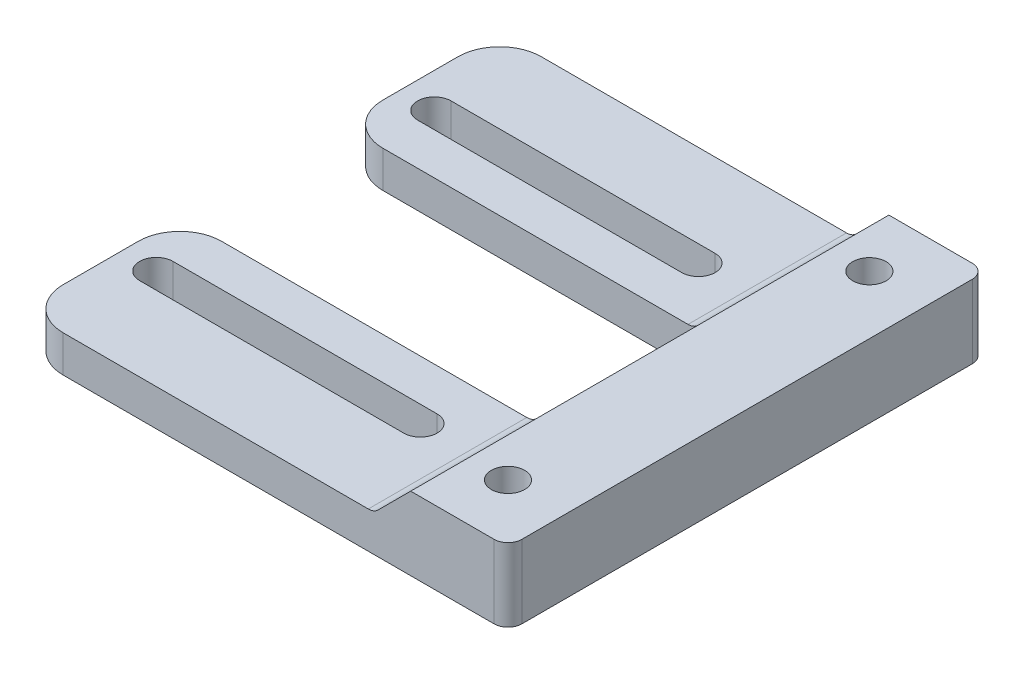
ISO-10303-21;
HEADER;
FILE_DESCRIPTION(('STEP AP214'),'2;1');
FILE_NAME('part.step','',(''),(''),'','','');
FILE_SCHEMA(('AUTOMOTIVE_DESIGN { 1 0 10303 214 1 1 1 1 }'));
ENDSEC;
DATA;
#1=APPLICATION_CONTEXT('core data for automotive mechanical design processes');
#2=APPLICATION_PROTOCOL_DEFINITION('international standard','automotive_design',2000,#1);
#3=PRODUCT_CONTEXT('',#1,'mechanical');
#4=PRODUCT('Part','Part','',(#3));
#5=PRODUCT_RELATED_PRODUCT_CATEGORY('part','',(#4));
#6=PRODUCT_DEFINITION_FORMATION('','',#4);
#7=PRODUCT_DEFINITION_CONTEXT('part definition',#1,'design');
#8=PRODUCT_DEFINITION('design','',#6,#7);
#9=PRODUCT_DEFINITION_SHAPE('','',#8);
#10=(LENGTH_UNIT() NAMED_UNIT(*) SI_UNIT(.MILLI.,.METRE.));
#11=(NAMED_UNIT(*) PLANE_ANGLE_UNIT() SI_UNIT($,.RADIAN.));
#12=(NAMED_UNIT(*) SI_UNIT($,.STERADIAN.) SOLID_ANGLE_UNIT());
#13=UNCERTAINTY_MEASURE_WITH_UNIT(LENGTH_MEASURE(1.E-05),#10,'distance_accuracy_value','');
#14=(GEOMETRIC_REPRESENTATION_CONTEXT(3) GLOBAL_UNCERTAINTY_ASSIGNED_CONTEXT((#13)) GLOBAL_UNIT_ASSIGNED_CONTEXT((#10,
#11,#12)) REPRESENTATION_CONTEXT('',''));
#15=CARTESIAN_POINT('',(0.,0.,0.));
#16=DIRECTION('',(0.,0.,1.));
#17=DIRECTION('',(1.,0.,0.));
#18=AXIS2_PLACEMENT_3D('',#15,#16,#17);
#19=CARTESIAN_POINT('',(0.,-2.635,17.2));
#20=DIRECTION('',(0.,-1.,0.));
#21=DIRECTION('',(1.,0.,0.));
#22=AXIS2_PLACEMENT_3D('',#19,#20,#21);
#23=PLANE('',#22);
#24=DIRECTION('',(1.,0.,0.));
#25=VECTOR('',#24,1.);
#26=CARTESIAN_POINT('',(-32.5,-2.635,11.2));
#27=LINE('',#26,#25);
#28=CARTESIAN_POINT('',(-32.5,-2.63500000000002,11.2));
#29=VERTEX_POINT('',#28);
#30=CARTESIAN_POINT('',(-13.5,-2.635,11.2));
#31=VERTEX_POINT('',#30);
#32=EDGE_CURVE('E312',#29,#31,#27,.T.);
#33=ORIENTED_EDGE('',*,*,#32,.F.);
#34=CARTESIAN_POINT('',(-32.5,-2.635,10.));
#35=DIRECTION('',(0.,1.,0.));
#36=DIRECTION('',(-1.,0.,0.));
#37=AXIS2_PLACEMENT_3D('',#34,#35,#36);
#38=CIRCLE('',#37,1.2);
#39=CARTESIAN_POINT('',(-32.5,-2.635,8.8));
#40=VERTEX_POINT('',#39);
#41=EDGE_CURVE('E316',#40,#29,#38,.T.);
#42=ORIENTED_EDGE('',*,*,#41,.F.);
#43=DIRECTION('',(-1.,0.,0.));
#44=VECTOR('',#43,1.);
#45=CARTESIAN_POINT('',(-32.5,-2.635,8.8));
#46=LINE('',#45,#44);
#47=CARTESIAN_POINT('',(-13.5,-2.635,8.8));
#48=VERTEX_POINT('',#47);
#49=EDGE_CURVE('E296',#48,#40,#46,.T.);
#50=ORIENTED_EDGE('',*,*,#49,.F.);
#51=CARTESIAN_POINT('',(-13.5,-2.635,10.));
#52=DIRECTION('',(0.,1.,0.));
#53=DIRECTION('',(-1.,0.,0.));
#54=AXIS2_PLACEMENT_3D('',#51,#52,#53);
#55=CIRCLE('',#54,1.2);
#56=EDGE_CURVE('E308',#31,#48,#55,.T.);
#57=ORIENTED_EDGE('',*,*,#56,.F.);
#58=EDGE_LOOP('',(#33,#42,#50,#57));
#59=FACE_BOUND('',#58,.T.);
#60=DIRECTION('',(0.,0.,-1.));
#61=VECTOR('',#60,1.);
#62=CARTESIAN_POINT('',(-35.,-2.63500000000002,17.2));
#63=LINE('',#62,#61);
#64=CARTESIAN_POINT('',(-35.,-2.63500000000002,14.2));
#65=VERTEX_POINT('',#64);
#66=CARTESIAN_POINT('',(-35.,-2.63500000000002,8.8));
#67=VERTEX_POINT('',#66);
#68=EDGE_CURVE('E405',#65,#67,#63,.T.);
#69=ORIENTED_EDGE('',*,*,#68,.F.);
#70=CARTESIAN_POINT('',(-32.,-2.63500000000002,14.2));
#71=DIRECTION('',(0.,-1.,0.));
#72=DIRECTION('',(1.,0.,0.));
#73=AXIS2_PLACEMENT_3D('',#70,#71,#72);
#74=CIRCLE('',#73,3.);
#75=CARTESIAN_POINT('',(-32.,-2.63500000000002,17.2));
#76=VERTEX_POINT('',#75);
#77=EDGE_CURVE('E502',#65,#76,#74,.F.);
#78=ORIENTED_EDGE('',*,*,#77,.T.);
#79=DIRECTION('',(-1.,0.,0.));
#80=VECTOR('',#79,1.);
#81=CARTESIAN_POINT('',(0.,-2.635,17.2));
#82=LINE('',#81,#80);
#83=CARTESIAN_POINT('',(-10.0492135623731,-2.635,17.2));
#84=VERTEX_POINT('',#83);
#85=EDGE_CURVE('E365',#84,#76,#82,.T.);
#86=ORIENTED_EDGE('',*,*,#85,.F.);
#87=DIRECTION('',(0.,0.,1.));
#88=VECTOR('',#87,1.);
#89=CARTESIAN_POINT('',(-10.0492135623731,-2.635,5.8));
#90=LINE('',#89,#88);
#91=CARTESIAN_POINT('',(-10.0492135623731,-2.635,5.8));
#92=VERTEX_POINT('',#91);
#93=EDGE_CURVE('E422',#84,#92,#90,.F.);
#94=ORIENTED_EDGE('',*,*,#93,.T.);
#95=DIRECTION('',(1.,0.,0.));
#96=VECTOR('',#95,1.);
#97=CARTESIAN_POINT('',(-35.,-2.635,5.8));
#98=LINE('',#97,#96);
#99=CARTESIAN_POINT('',(-32.,-2.635,5.8));
#100=VERTEX_POINT('',#99);
#101=EDGE_CURVE('E341',#100,#92,#98,.T.);
#102=ORIENTED_EDGE('',*,*,#101,.F.);
#103=CARTESIAN_POINT('',(-32.,-2.63500000000002,8.8));
#104=DIRECTION('',(0.,-1.,0.));
#105=DIRECTION('',(1.,0.,0.));
#106=AXIS2_PLACEMENT_3D('',#103,#104,#105);
#107=CIRCLE('',#106,3.);
#108=EDGE_CURVE('E499',#100,#67,#107,.F.);
#109=ORIENTED_EDGE('',*,*,#108,.T.);
#110=EDGE_LOOP('',(#69,#78,#86,#94,#102,#109));
#111=FACE_BOUND('',#110,.T.);
#112=ADVANCED_FACE('F47',(#59,#111),#23,.F.);
#113=CARTESIAN_POINT('',(-35.,0.,17.2));
#114=DIRECTION('',(1.,0.,0.));
#115=DIRECTION('',(0.,0.,-1.));
#116=AXIS2_PLACEMENT_3D('',#113,#114,#115);
#117=PLANE('',#116);
#118=DIRECTION('',(0.,0.,-1.));
#119=VECTOR('',#118,1.);
#120=CARTESIAN_POINT('',(-35.,-5.27,17.2));
#121=LINE('',#120,#119);
#122=CARTESIAN_POINT('',(-35.,-5.27,14.2));
#123=VERTEX_POINT('',#122);
#124=CARTESIAN_POINT('',(-35.,-5.27,8.8));
#125=VERTEX_POINT('',#124);
#126=EDGE_CURVE('E397',#123,#125,#121,.T.);
#127=ORIENTED_EDGE('',*,*,#126,.F.);
#128=DIRECTION('',(0.,-1.,0.));
#129=VECTOR('',#128,1.);
#130=CARTESIAN_POINT('',(-35.,-2.63500000000002,14.2));
#131=LINE('',#130,#129);
#132=EDGE_CURVE('E496',#123,#65,#131,.F.);
#133=ORIENTED_EDGE('',*,*,#132,.T.);
#134=ORIENTED_EDGE('',*,*,#68,.T.);
#135=DIRECTION('',(0.,1.,0.));
#136=VECTOR('',#135,1.);
#137=CARTESIAN_POINT('',(-35.,0.,8.8));
#138=LINE('',#137,#136);
#139=EDGE_CURVE('E493',#67,#125,#138,.F.);
#140=ORIENTED_EDGE('',*,*,#139,.T.);
#141=EDGE_LOOP('',(#127,#133,#134,#140));
#142=FACE_BOUND('',#141,.T.);
#143=ADVANCED_FACE('F571',(#142),#117,.F.);
#144=DIRECTION('',(1.,0.,0.));
#145=VECTOR('',#144,1.);
#146=CARTESIAN_POINT('',(-32.5,-2.635,-8.8));
#147=LINE('',#146,#145);
#148=CARTESIAN_POINT('',(-32.5,-2.63500000000002,-8.8));
#149=VERTEX_POINT('',#148);
#150=CARTESIAN_POINT('',(-13.5,-2.635,-8.8));
#151=VERTEX_POINT('',#150);
#152=EDGE_CURVE('E270',#149,#151,#147,.T.);
#153=ORIENTED_EDGE('',*,*,#152,.F.);
#154=CARTESIAN_POINT('',(-32.5,-2.635,-10.));
#155=DIRECTION('',(0.,1.,0.));
#156=DIRECTION('',(-1.,0.,0.));
#157=AXIS2_PLACEMENT_3D('',#154,#155,#156);
#158=CIRCLE('',#157,1.2);
#159=CARTESIAN_POINT('',(-32.5,-2.635,-11.2));
#160=VERTEX_POINT('',#159);
#161=EDGE_CURVE('E245',#160,#149,#158,.T.);
#162=ORIENTED_EDGE('',*,*,#161,.F.);
#163=DIRECTION('',(-1.,0.,0.));
#164=VECTOR('',#163,1.);
#165=CARTESIAN_POINT('',(-32.5,-2.635,-11.2));
#166=LINE('',#165,#164);
#167=CARTESIAN_POINT('',(-13.5,-2.635,-11.2));
#168=VERTEX_POINT('',#167);
#169=EDGE_CURVE('E256',#168,#160,#166,.T.);
#170=ORIENTED_EDGE('',*,*,#169,.F.);
#171=CARTESIAN_POINT('',(-13.5,-2.635,-10.));
#172=DIRECTION('',(0.,1.,0.));
#173=DIRECTION('',(-1.,0.,0.));
#174=AXIS2_PLACEMENT_3D('',#171,#172,#173);
#175=CIRCLE('',#174,1.2);
#176=EDGE_CURVE('E263',#151,#168,#175,.T.);
#177=ORIENTED_EDGE('',*,*,#176,.F.);
#178=EDGE_LOOP('',(#153,#162,#170,#177));
#179=FACE_BOUND('',#178,.T.);
#180=CARTESIAN_POINT('',(-35.,-2.63500000000002,-8.8));
#181=VERTEX_POINT('',#180);
#182=CARTESIAN_POINT('',(-35.,-2.63500000000002,-14.2));
#183=VERTEX_POINT('',#182);
#184=EDGE_CURVE('E401',#181,#183,#63,.T.);
#185=ORIENTED_EDGE('',*,*,#184,.F.);
#186=CARTESIAN_POINT('',(-32.,-2.63500000000002,-8.8));
#187=DIRECTION('',(0.,-1.,0.));
#188=DIRECTION('',(1.,0.,0.));
#189=AXIS2_PLACEMENT_3D('',#186,#187,#188);
#190=CIRCLE('',#189,3.);
#191=CARTESIAN_POINT('',(-32.,-2.635,-5.8));
#192=VERTEX_POINT('',#191);
#193=EDGE_CURVE('E520',#181,#192,#190,.F.);
#194=ORIENTED_EDGE('',*,*,#193,.T.);
#195=DIRECTION('',(-1.,0.,0.));
#196=VECTOR('',#195,1.);
#197=CARTESIAN_POINT('',(-35.,-2.635,-5.8));
#198=LINE('',#197,#196);
#199=CARTESIAN_POINT('',(-10.0492135623731,-2.635,-5.8));
#200=VERTEX_POINT('',#199);
#201=EDGE_CURVE('E337',#200,#192,#198,.T.);
#202=ORIENTED_EDGE('',*,*,#201,.F.);
#203=DIRECTION('',(0.,0.,1.));
#204=VECTOR('',#203,1.);
#205=CARTESIAN_POINT('',(-10.0492135623731,-2.635,-17.2));
#206=LINE('',#205,#204);
#207=CARTESIAN_POINT('',(-10.0492135623731,-2.635,-17.2));
#208=VERTEX_POINT('',#207);
#209=EDGE_CURVE('E429',#200,#208,#206,.F.);
#210=ORIENTED_EDGE('',*,*,#209,.T.);
#211=DIRECTION('',(-1.,0.,0.));
#212=VECTOR('',#211,1.);
#213=CARTESIAN_POINT('',(0.,-2.635,-17.2));
#214=LINE('',#213,#212);
#215=CARTESIAN_POINT('',(-32.,-2.63500000000002,-17.2));
#216=VERTEX_POINT('',#215);
#217=EDGE_CURVE('E353',#208,#216,#214,.T.);
#218=ORIENTED_EDGE('',*,*,#217,.T.);
#219=CARTESIAN_POINT('',(-32.,-2.63500000000002,-14.2));
#220=DIRECTION('',(0.,-1.,0.));
#221=DIRECTION('',(1.,0.,0.));
#222=AXIS2_PLACEMENT_3D('',#219,#220,#221);
#223=CIRCLE('',#222,3.);
#224=EDGE_CURVE('E517',#216,#183,#223,.F.);
#225=ORIENTED_EDGE('',*,*,#224,.T.);
#226=EDGE_LOOP('',(#185,#194,#202,#210,#218,#225));
#227=FACE_BOUND('',#226,.T.);
#228=ADVANCED_FACE('F267',(#179,#227),#23,.F.);
#229=CARTESIAN_POINT('',(-35.,-5.27,-8.8));
#230=VERTEX_POINT('',#229);
#231=CARTESIAN_POINT('',(-35.,-5.27,-14.2));
#232=VERTEX_POINT('',#231);
#233=EDGE_CURVE('E396',#230,#232,#121,.T.);
#234=ORIENTED_EDGE('',*,*,#233,.F.);
#235=DIRECTION('',(0.,1.,0.));
#236=VECTOR('',#235,1.);
#237=CARTESIAN_POINT('',(-35.,0.,-8.8));
#238=LINE('',#237,#236);
#239=EDGE_CURVE('E513',#230,#181,#238,.T.);
#240=ORIENTED_EDGE('',*,*,#239,.T.);
#241=ORIENTED_EDGE('',*,*,#184,.T.);
#242=DIRECTION('',(0.,-1.,0.));
#243=VECTOR('',#242,1.);
#244=CARTESIAN_POINT('',(-35.,0.,-14.2));
#245=LINE('',#244,#243);
#246=EDGE_CURVE('E509',#183,#232,#245,.T.);
#247=ORIENTED_EDGE('',*,*,#246,.T.);
#248=EDGE_LOOP('',(#234,#240,#241,#247));
#249=FACE_BOUND('',#248,.T.);
#250=ADVANCED_FACE('F612',(#249),#117,.F.);
#251=CARTESIAN_POINT('',(0.,-5.27,17.2));
#252=DIRECTION('',(0.,-1.,0.));
#253=DIRECTION('',(1.,0.,0.));
#254=AXIS2_PLACEMENT_3D('',#251,#252,#253);
#255=PLANE('',#254);
#256=CARTESIAN_POINT('',(-32.5,-5.27,10.));
#257=DIRECTION('',(0.,-1.,0.));
#258=DIRECTION('',(1.,0.,0.));
#259=AXIS2_PLACEMENT_3D('',#256,#257,#258);
#260=CIRCLE('',#259,1.2);
#261=CARTESIAN_POINT('',(-32.5,-5.27,8.8));
#262=VERTEX_POINT('',#261);
#263=CARTESIAN_POINT('',(-32.5,-5.27,11.2));
#264=VERTEX_POINT('',#263);
#265=EDGE_CURVE('E319',#262,#264,#260,.F.);
#266=ORIENTED_EDGE('',*,*,#265,.T.);
#267=DIRECTION('',(1.,0.,0.));
#268=VECTOR('',#267,1.);
#269=CARTESIAN_POINT('',(-32.5,-5.27,11.2));
#270=LINE('',#269,#268);
#271=CARTESIAN_POINT('',(-13.5,-5.27,11.2));
#272=VERTEX_POINT('',#271);
#273=EDGE_CURVE('E287',#264,#272,#270,.T.);
#274=ORIENTED_EDGE('',*,*,#273,.T.);
#275=CARTESIAN_POINT('',(-13.5,-5.27,10.));
#276=DIRECTION('',(0.,-1.,0.));
#277=DIRECTION('',(1.,0.,0.));
#278=AXIS2_PLACEMENT_3D('',#275,#276,#277);
#279=CIRCLE('',#278,1.2);
#280=CARTESIAN_POINT('',(-13.5,-5.27,8.8));
#281=VERTEX_POINT('',#280);
#282=EDGE_CURVE('E327',#272,#281,#279,.F.);
#283=ORIENTED_EDGE('',*,*,#282,.T.);
#284=DIRECTION('',(-1.,0.,0.));
#285=VECTOR('',#284,1.);
#286=CARTESIAN_POINT('',(-32.5,-5.27,8.8));
#287=LINE('',#286,#285);
#288=EDGE_CURVE('E323',#281,#262,#287,.T.);
#289=ORIENTED_EDGE('',*,*,#288,.T.);
#290=EDGE_LOOP('',(#266,#274,#283,#289));
#291=FACE_BOUND('',#290,.T.);
#292=CARTESIAN_POINT('',(-32.5,-5.27,-10.));
#293=DIRECTION('',(0.,-1.,0.));
#294=DIRECTION('',(1.,0.,0.));
#295=AXIS2_PLACEMENT_3D('',#292,#293,#294);
#296=CIRCLE('',#295,1.2);
#297=CARTESIAN_POINT('',(-32.5,-5.27,-11.2));
#298=VERTEX_POINT('',#297);
#299=CARTESIAN_POINT('',(-32.5,-5.27,-8.8));
#300=VERTEX_POINT('',#299);
#301=EDGE_CURVE('E248',#298,#300,#296,.F.);
#302=ORIENTED_EDGE('',*,*,#301,.T.);
#303=DIRECTION('',(1.,0.,0.));
#304=VECTOR('',#303,1.);
#305=CARTESIAN_POINT('',(-32.5,-5.27,-8.8));
#306=LINE('',#305,#304);
#307=CARTESIAN_POINT('',(-13.5,-5.27,-8.8));
#308=VERTEX_POINT('',#307);
#309=EDGE_CURVE('E253',#300,#308,#306,.T.);
#310=ORIENTED_EDGE('',*,*,#309,.T.);
#311=CARTESIAN_POINT('',(-13.5,-5.27,-10.));
#312=DIRECTION('',(0.,-1.,0.));
#313=DIRECTION('',(1.,0.,0.));
#314=AXIS2_PLACEMENT_3D('',#311,#312,#313);
#315=CIRCLE('',#314,1.2);
#316=CARTESIAN_POINT('',(-13.5,-5.27,-11.2));
#317=VERTEX_POINT('',#316);
#318=EDGE_CURVE('E282',#308,#317,#315,.F.);
#319=ORIENTED_EDGE('',*,*,#318,.T.);
#320=DIRECTION('',(-1.,0.,0.));
#321=VECTOR('',#320,1.);
#322=CARTESIAN_POINT('',(-32.5,-5.27,-11.2));
#323=LINE('',#322,#321);
#324=EDGE_CURVE('E275',#317,#298,#323,.T.);
#325=ORIENTED_EDGE('',*,*,#324,.T.);
#326=EDGE_LOOP('',(#302,#310,#319,#325));
#327=FACE_BOUND('',#326,.T.);
#328=DIRECTION('',(0.,0.,-1.));
#329=VECTOR('',#328,1.);
#330=CARTESIAN_POINT('',(0.,-5.27,17.2));
#331=LINE('',#330,#329);
#332=CARTESIAN_POINT('',(0.,-5.27,16.2));
#333=VERTEX_POINT('',#332);
#334=CARTESIAN_POINT('',(0.,-5.27,-16.2));
#335=VERTEX_POINT('',#334);
#336=EDGE_CURVE('E392',#333,#335,#331,.T.);
#337=ORIENTED_EDGE('',*,*,#336,.F.);
#338=CARTESIAN_POINT('',(-1.,-5.27,16.2));
#339=DIRECTION('',(0.,-1.,0.));
#340=DIRECTION('',(1.,0.,0.));
#341=AXIS2_PLACEMENT_3D('',#338,#339,#340);
#342=CIRCLE('',#341,1.);
#343=CARTESIAN_POINT('',(-1.,-5.27,17.2));
#344=VERTEX_POINT('',#343);
#345=EDGE_CURVE('E539',#333,#344,#342,.T.);
#346=ORIENTED_EDGE('',*,*,#345,.T.);
#347=DIRECTION('',(-1.,0.,0.));
#348=VECTOR('',#347,1.);
#349=CARTESIAN_POINT('',(0.,-5.27,17.2));
#350=LINE('',#349,#348);
#351=CARTESIAN_POINT('',(-32.,-5.27,17.2));
#352=VERTEX_POINT('',#351);
#353=EDGE_CURVE('E369',#344,#352,#350,.T.);
#354=ORIENTED_EDGE('',*,*,#353,.T.);
#355=CARTESIAN_POINT('',(-32.,-5.27,14.2));
#356=DIRECTION('',(0.,-1.,0.));
#357=DIRECTION('',(1.,0.,0.));
#358=AXIS2_PLACEMENT_3D('',#355,#356,#357);
#359=CIRCLE('',#358,3.);
#360=EDGE_CURVE('E490',#352,#123,#359,.T.);
#361=ORIENTED_EDGE('',*,*,#360,.T.);
#362=ORIENTED_EDGE('',*,*,#126,.T.);
#363=CARTESIAN_POINT('',(-32.,-5.27,8.8));
#364=DIRECTION('',(0.,-1.,0.));
#365=DIRECTION('',(1.,0.,0.));
#366=AXIS2_PLACEMENT_3D('',#363,#364,#365);
#367=CIRCLE('',#366,3.);
#368=CARTESIAN_POINT('',(-32.,-5.27,5.8));
#369=VERTEX_POINT('',#368);
#370=EDGE_CURVE('E487',#125,#369,#367,.T.);
#371=ORIENTED_EDGE('',*,*,#370,.T.);
#372=DIRECTION('',(1.,0.,0.));
#373=VECTOR('',#372,1.);
#374=CARTESIAN_POINT('',(-35.,-5.27,5.8));
#375=LINE('',#374,#373);
#376=CARTESIAN_POINT('',(-8.,-5.27,5.8));
#377=VERTEX_POINT('',#376);
#378=EDGE_CURVE('E334',#369,#377,#375,.T.);
#379=ORIENTED_EDGE('',*,*,#378,.T.);
#380=CARTESIAN_POINT('',(-8.,-5.27,4.8));
#381=DIRECTION('',(0.,-1.,0.));
#382=DIRECTION('',(1.,0.,0.));
#383=AXIS2_PLACEMENT_3D('',#380,#381,#382);
#384=CIRCLE('',#383,1.);
#385=CARTESIAN_POINT('',(-7.,-5.27,4.8));
#386=VERTEX_POINT('',#385);
#387=EDGE_CURVE('E473',#377,#386,#384,.F.);
#388=ORIENTED_EDGE('',*,*,#387,.T.);
#389=DIRECTION('',(0.,0.,-1.));
#390=VECTOR('',#389,1.);
#391=CARTESIAN_POINT('',(-7.,-5.27,5.8));
#392=LINE('',#391,#390);
#393=CARTESIAN_POINT('',(-7.,-5.27,-4.8));
#394=VERTEX_POINT('',#393);
#395=EDGE_CURVE('E286',#386,#394,#392,.T.);
#396=ORIENTED_EDGE('',*,*,#395,.T.);
#397=CARTESIAN_POINT('',(-8.,-5.27,-4.8));
#398=DIRECTION('',(0.,-1.,0.));
#399=DIRECTION('',(1.,0.,0.));
#400=AXIS2_PLACEMENT_3D('',#397,#398,#399);
#401=CIRCLE('',#400,1.);
#402=CARTESIAN_POINT('',(-8.,-5.27,-5.8));
#403=VERTEX_POINT('',#402);
#404=EDGE_CURVE('E467',#394,#403,#401,.F.);
#405=ORIENTED_EDGE('',*,*,#404,.T.);
#406=DIRECTION('',(-1.,0.,0.));
#407=VECTOR('',#406,1.);
#408=CARTESIAN_POINT('',(-35.,-5.27,-5.8));
#409=LINE('',#408,#407);
#410=CARTESIAN_POINT('',(-32.,-5.27,-5.8));
#411=VERTEX_POINT('',#410);
#412=EDGE_CURVE('E344',#403,#411,#409,.T.);
#413=ORIENTED_EDGE('',*,*,#412,.T.);
#414=CARTESIAN_POINT('',(-32.,-5.27,-8.8));
#415=DIRECTION('',(0.,-1.,0.));
#416=DIRECTION('',(1.,0.,0.));
#417=AXIS2_PLACEMENT_3D('',#414,#415,#416);
#418=CIRCLE('',#417,3.);
#419=EDGE_CURVE('E484',#411,#230,#418,.T.);
#420=ORIENTED_EDGE('',*,*,#419,.T.);
#421=ORIENTED_EDGE('',*,*,#233,.T.);
#422=CARTESIAN_POINT('',(-32.,-5.27,-14.2));
#423=DIRECTION('',(0.,-1.,0.));
#424=DIRECTION('',(1.,0.,0.));
#425=AXIS2_PLACEMENT_3D('',#422,#423,#424);
#426=CIRCLE('',#425,3.);
#427=CARTESIAN_POINT('',(-32.,-5.27,-17.2));
#428=VERTEX_POINT('',#427);
#429=EDGE_CURVE('E480',#232,#428,#426,.T.);
#430=ORIENTED_EDGE('',*,*,#429,.T.);
#431=DIRECTION('',(-1.,0.,0.));
#432=VECTOR('',#431,1.);
#433=CARTESIAN_POINT('',(0.,-5.27,-17.2));
#434=LINE('',#433,#432);
#435=CARTESIAN_POINT('',(-1.,-5.27,-17.2));
#436=VERTEX_POINT('',#435);
#437=EDGE_CURVE('E380',#436,#428,#434,.T.);
#438=ORIENTED_EDGE('',*,*,#437,.F.);
#439=CARTESIAN_POINT('',(-1.,-5.27,-16.2));
#440=DIRECTION('',(0.,-1.,0.));
#441=DIRECTION('',(1.,0.,0.));
#442=AXIS2_PLACEMENT_3D('',#439,#440,#441);
#443=CIRCLE('',#442,1.);
#444=EDGE_CURVE('E536',#436,#335,#443,.T.);
#445=ORIENTED_EDGE('',*,*,#444,.T.);
#446=EDGE_LOOP('',(#337,#346,#354,#361,#362,#371,#379,#388,#396,#405,#413,#420,#421,#430,#438,#445));
#447=FACE_BOUND('',#446,.T.);
#448=CARTESIAN_POINT('',(-4.2,-5.27,-13.));
#449=DIRECTION('',(0.,-1.,0.));
#450=DIRECTION('',(1.,0.,0.));
#451=AXIS2_PLACEMENT_3D('',#448,#449,#450);
#452=CIRCLE('',#451,1.2);
#453=CARTESIAN_POINT('',(-3.,-5.27,-13.));
#454=VERTEX_POINT('',#453);
#455=EDGE_CURVE('E354',#454,#454,#452,.F.);
#456=ORIENTED_EDGE('',*,*,#455,.T.);
#457=EDGE_LOOP('',(#456));
#458=FACE_BOUND('',#457,.T.);
#459=CARTESIAN_POINT('',(-4.2,-5.27,13.));
#460=DIRECTION('',(0.,-1.,0.));
#461=DIRECTION('',(1.,0.,0.));
#462=AXIS2_PLACEMENT_3D('',#459,#460,#461);
#463=CIRCLE('',#462,1.2);
#464=CARTESIAN_POINT('',(-3.,-5.27,13.));
#465=VERTEX_POINT('',#464);
#466=EDGE_CURVE('E358',#465,#465,#463,.F.);
#467=ORIENTED_EDGE('',*,*,#466,.T.);
#468=EDGE_LOOP('',(#467));
#469=FACE_BOUND('',#468,.T.);
#470=ADVANCED_FACE('F558',(#291,#327,#447,#458,#469),#255,.T.);
#471=CARTESIAN_POINT('',(0.,0.,17.2));
#472=DIRECTION('',(1.,0.,0.));
#473=DIRECTION('',(0.,0.,-1.));
#474=AXIS2_PLACEMENT_3D('',#471,#472,#473);
#475=PLANE('',#474);
#476=DIRECTION('',(0.,0.,-1.));
#477=VECTOR('',#476,1.);
#478=CARTESIAN_POINT('',(0.,0.,17.2));
#479=LINE('',#478,#477);
#480=CARTESIAN_POINT('',(0.,0.,16.2));
#481=VERTEX_POINT('',#480);
#482=CARTESIAN_POINT('',(0.,0.,-16.2));
#483=VERTEX_POINT('',#482);
#484=EDGE_CURVE('E388',#481,#483,#479,.T.);
#485=ORIENTED_EDGE('',*,*,#484,.F.);
#486=DIRECTION('',(0.,-1.,0.));
#487=VECTOR('',#486,1.);
#488=CARTESIAN_POINT('',(0.,0.,16.2));
#489=LINE('',#488,#487);
#490=EDGE_CURVE('E532',#481,#333,#489,.T.);
#491=ORIENTED_EDGE('',*,*,#490,.T.);
#492=ORIENTED_EDGE('',*,*,#336,.T.);
#493=DIRECTION('',(0.,-1.,0.));
#494=VECTOR('',#493,1.);
#495=CARTESIAN_POINT('',(0.,0.,-16.2));
#496=LINE('',#495,#494);
#497=EDGE_CURVE('E529',#335,#483,#496,.F.);
#498=ORIENTED_EDGE('',*,*,#497,.T.);
#499=EDGE_LOOP('',(#485,#491,#492,#498));
#500=FACE_BOUND('',#499,.T.);
#501=ADVANCED_FACE('F553',(#500),#475,.T.);
#502=CARTESIAN_POINT('',(0.,0.,17.2));
#503=DIRECTION('',(0.,-1.,0.));
#504=DIRECTION('',(1.,0.,0.));
#505=AXIS2_PLACEMENT_3D('',#502,#503,#504);
#506=PLANE('',#505);
#507=CARTESIAN_POINT('',(-4.2,0.,-13.));
#508=DIRECTION('',(0.,1.,0.));
#509=DIRECTION('',(0.,0.,1.));
#510=AXIS2_PLACEMENT_3D('',#507,#508,#509);
#511=CIRCLE('',#510,1.2);
#512=CARTESIAN_POINT('',(-4.2,0.,-11.8));
#513=VERTEX_POINT('',#512);
#514=EDGE_CURVE('E349',#513,#513,#511,.T.);
#515=ORIENTED_EDGE('',*,*,#514,.F.);
#516=EDGE_LOOP('',(#515));
#517=FACE_BOUND('',#516,.T.);
#518=CARTESIAN_POINT('',(-4.2,0.,13.));
#519=DIRECTION('',(0.,1.,0.));
#520=DIRECTION('',(0.,0.,1.));
#521=AXIS2_PLACEMENT_3D('',#518,#519,#520);
#522=CIRCLE('',#521,1.2);
#523=CARTESIAN_POINT('',(-4.2,0.,14.2));
#524=VERTEX_POINT('',#523);
#525=EDGE_CURVE('E348',#524,#524,#522,.T.);
#526=ORIENTED_EDGE('',*,*,#525,.F.);
#527=EDGE_LOOP('',(#526));
#528=FACE_BOUND('',#527,.T.);
#529=DIRECTION('',(-1.,0.,0.));
#530=VECTOR('',#529,1.);
#531=CARTESIAN_POINT('',(0.,0.,17.2));
#532=LINE('',#531,#530);
#533=CARTESIAN_POINT('',(-1.,0.,17.2));
#534=VERTEX_POINT('',#533);
#535=CARTESIAN_POINT('',(-7.,0.,17.2));
#536=VERTEX_POINT('',#535);
#537=EDGE_CURVE('E373',#534,#536,#532,.T.);
#538=ORIENTED_EDGE('',*,*,#537,.F.);
#539=CARTESIAN_POINT('',(-1.,0.,16.2));
#540=DIRECTION('',(0.,-1.,0.));
#541=DIRECTION('',(1.,0.,0.));
#542=AXIS2_PLACEMENT_3D('',#539,#540,#541);
#543=CIRCLE('',#542,1.);
#544=EDGE_CURVE('E56',#534,#481,#543,.F.);
#545=ORIENTED_EDGE('',*,*,#544,.T.);
#546=ORIENTED_EDGE('',*,*,#484,.T.);
#547=CARTESIAN_POINT('',(-1.,0.,-16.2));
#548=DIRECTION('',(0.,-1.,0.));
#549=DIRECTION('',(1.,0.,0.));
#550=AXIS2_PLACEMENT_3D('',#547,#548,#549);
#551=CIRCLE('',#550,1.);
#552=CARTESIAN_POINT('',(-1.,0.,-17.2));
#553=VERTEX_POINT('',#552);
#554=EDGE_CURVE('E63',#483,#553,#551,.F.);
#555=ORIENTED_EDGE('',*,*,#554,.T.);
#556=DIRECTION('',(-1.,0.,0.));
#557=VECTOR('',#556,1.);
#558=CARTESIAN_POINT('',(0.,0.,-17.2));
#559=LINE('',#558,#557);
#560=CARTESIAN_POINT('',(-7.,0.,-17.2));
#561=VERTEX_POINT('',#560);
#562=EDGE_CURVE('E370',#553,#561,#559,.T.);
#563=ORIENTED_EDGE('',*,*,#562,.T.);
#564=DIRECTION('',(0.,0.,-1.));
#565=VECTOR('',#564,1.);
#566=CARTESIAN_POINT('',(-7.,0.,17.2));
#567=LINE('',#566,#565);
#568=CARTESIAN_POINT('',(-7.,0.,-4.79999999999999));
#569=VERTEX_POINT('',#568);
#570=EDGE_CURVE('E376',#569,#561,#567,.T.);
#571=ORIENTED_EDGE('',*,*,#570,.F.);
#572=CARTESIAN_POINT('',(-7.,0.,4.80000000000001));
#573=VERTEX_POINT('',#572);
#574=EDGE_CURVE('E389',#573,#569,#567,.T.);
#575=ORIENTED_EDGE('',*,*,#574,.F.);
#576=EDGE_CURVE('E385',#536,#573,#567,.T.);
#577=ORIENTED_EDGE('',*,*,#576,.F.);
#578=EDGE_LOOP('',(#538,#545,#546,#555,#563,#571,#575,#577));
#579=FACE_BOUND('',#578,.T.);
#580=ADVANCED_FACE('F548',(#517,#528,#579),#506,.F.);
#581=CARTESIAN_POINT('',(-7.,0.,17.2));
#582=DIRECTION('',(1.,0.,0.));
#583=DIRECTION('',(0.,0.,-1.));
#584=AXIS2_PLACEMENT_3D('',#581,#582,#583);
#585=PLANE('',#584);
#586=ORIENTED_EDGE('',*,*,#574,.T.);
#587=DIRECTION('',(0.,1.,0.));
#588=VECTOR('',#587,1.);
#589=CARTESIAN_POINT('',(-7.,-5.27,-4.8));
#590=LINE('',#589,#588);
#591=EDGE_CURVE('E444',#569,#394,#590,.F.);
#592=ORIENTED_EDGE('',*,*,#591,.T.);
#593=ORIENTED_EDGE('',*,*,#395,.F.);
#594=DIRECTION('',(0.,1.,0.));
#595=VECTOR('',#594,1.);
#596=CARTESIAN_POINT('',(-7.,0.,4.8));
#597=LINE('',#596,#595);
#598=EDGE_CURVE('E440',#386,#573,#597,.T.);
#599=ORIENTED_EDGE('',*,*,#598,.T.);
#600=EDGE_LOOP('',(#586,#592,#593,#599));
#601=FACE_BOUND('',#600,.T.);
#602=ADVANCED_FACE('F593',(#601),#585,.F.);
#603=CARTESIAN_POINT('',(0.,0.,17.2));
#604=DIRECTION('',(0.,0.,1.));
#605=DIRECTION('',(1.,0.,0.));
#606=AXIS2_PLACEMENT_3D('',#603,#604,#605);
#607=PLANE('',#606);
#608=ORIENTED_EDGE('',*,*,#353,.F.);
#609=DIRECTION('',(0.,-1.,0.));
#610=VECTOR('',#609,1.);
#611=CARTESIAN_POINT('',(-1.,0.,17.2));
#612=LINE('',#611,#610);
#613=EDGE_CURVE('E71',#344,#534,#612,.F.);
#614=ORIENTED_EDGE('',*,*,#613,.T.);
#615=ORIENTED_EDGE('',*,*,#537,.T.);
#616=DIRECTION('',(0.707106781186547,0.707106781186548,0.));
#617=VECTOR('',#616,1.);
#618=CARTESIAN_POINT('',(-9.63499999999999,-2.635,17.2));
#619=LINE('',#618,#617);
#620=CARTESIAN_POINT('',(-9.34210678118654,-2.34210678118655,17.2));
#621=VERTEX_POINT('',#620);
#622=EDGE_CURVE('E410',#536,#621,#619,.F.);
#623=ORIENTED_EDGE('',*,*,#622,.T.);
#624=CARTESIAN_POINT('',(-10.0492135623731,-1.635,17.2));
#625=DIRECTION('',(0.,0.,1.));
#626=DIRECTION('',(1.,0.,0.));
#627=AXIS2_PLACEMENT_3D('',#624,#625,#626);
#628=CIRCLE('',#627,1.);
#629=EDGE_CURVE('E454',#621,#84,#628,.F.);
#630=ORIENTED_EDGE('',*,*,#629,.T.);
#631=ORIENTED_EDGE('',*,*,#85,.T.);
#632=DIRECTION('',(0.,-1.,0.));
#633=VECTOR('',#632,1.);
#634=CARTESIAN_POINT('',(-32.,-5.27,17.2));
#635=LINE('',#634,#633);
#636=EDGE_CURVE('E476',#76,#352,#635,.T.);
#637=ORIENTED_EDGE('',*,*,#636,.T.);
#638=EDGE_LOOP('',(#608,#614,#615,#623,#630,#631,#637));
#639=FACE_BOUND('',#638,.T.);
#640=ADVANCED_FACE('F561',(#639),#607,.T.);
#641=CARTESIAN_POINT('',(0.,0.,-17.2));
#642=DIRECTION('',(0.,0.,1.));
#643=DIRECTION('',(1.,0.,0.));
#644=AXIS2_PLACEMENT_3D('',#641,#642,#643);
#645=PLANE('',#644);
#646=ORIENTED_EDGE('',*,*,#562,.F.);
#647=DIRECTION('',(0.,-1.,0.));
#648=VECTOR('',#647,1.);
#649=CARTESIAN_POINT('',(-1.,-5.27,-17.2));
#650=LINE('',#649,#648);
#651=EDGE_CURVE('E11',#553,#436,#650,.T.);
#652=ORIENTED_EDGE('',*,*,#651,.T.);
#653=ORIENTED_EDGE('',*,*,#437,.T.);
#654=DIRECTION('',(0.,-1.,0.));
#655=VECTOR('',#654,1.);
#656=CARTESIAN_POINT('',(-32.,0.,-17.2));
#657=LINE('',#656,#655);
#658=EDGE_CURVE('E526',#428,#216,#657,.F.);
#659=ORIENTED_EDGE('',*,*,#658,.T.);
#660=ORIENTED_EDGE('',*,*,#217,.F.);
#661=CARTESIAN_POINT('',(-10.0492135623731,-1.635,-17.2));
#662=DIRECTION('',(0.,0.,1.));
#663=DIRECTION('',(1.,0.,0.));
#664=AXIS2_PLACEMENT_3D('',#661,#662,#663);
#665=CIRCLE('',#664,1.);
#666=CARTESIAN_POINT('',(-9.34210678118654,-2.34210678118655,-17.2));
#667=VERTEX_POINT('',#666);
#668=EDGE_CURVE('E457',#208,#667,#665,.T.);
#669=ORIENTED_EDGE('',*,*,#668,.T.);
#670=DIRECTION('',(-0.707106781186547,-0.707106781186548,0.));
#671=VECTOR('',#670,1.);
#672=CARTESIAN_POINT('',(-3.49999999999999,3.49999999999999,-17.2));
#673=LINE('',#672,#671);
#674=EDGE_CURVE('E414',#667,#561,#673,.F.);
#675=ORIENTED_EDGE('',*,*,#674,.T.);
#676=EDGE_LOOP('',(#646,#652,#653,#659,#660,#669,#675));
#677=FACE_BOUND('',#676,.T.);
#678=ADVANCED_FACE('F625',(#677),#645,.F.);
#679=CARTESIAN_POINT('',(-4.2,-5.271,13.));
#680=DIRECTION('',(0.,1.,0.));
#681=DIRECTION('',(0.,0.,1.));
#682=AXIS2_PLACEMENT_3D('',#679,#680,#681);
#683=CYLINDRICAL_SURFACE('',#682,1.2);
#684=ORIENTED_EDGE('',*,*,#466,.F.);
#685=EDGE_LOOP('',(#684));
#686=FACE_BOUND('',#685,.T.);
#687=ORIENTED_EDGE('',*,*,#525,.T.);
#688=EDGE_LOOP('',(#687));
#689=FACE_BOUND('',#688,.T.);
#690=ADVANCED_FACE('F670',(#686,#689),#683,.F.);
#691=CARTESIAN_POINT('',(-4.2,-5.271,-13.));
#692=DIRECTION('',(0.,1.,0.));
#693=DIRECTION('',(0.,0.,1.));
#694=AXIS2_PLACEMENT_3D('',#691,#692,#693);
#695=CYLINDRICAL_SURFACE('',#694,1.2);
#696=ORIENTED_EDGE('',*,*,#455,.F.);
#697=EDGE_LOOP('',(#696));
#698=FACE_BOUND('',#697,.T.);
#699=ORIENTED_EDGE('',*,*,#514,.T.);
#700=EDGE_LOOP('',(#699));
#701=FACE_BOUND('',#700,.T.);
#702=ADVANCED_FACE('F675',(#698,#701),#695,.F.);
#703=CARTESIAN_POINT('',(-35.,-5.27100000000001,5.8));
#704=DIRECTION('',(0.,0.,1.));
#705=DIRECTION('',(1.,0.,0.));
#706=AXIS2_PLACEMENT_3D('',#703,#704,#705);
#707=PLANE('',#706);
#708=ORIENTED_EDGE('',*,*,#378,.F.);
#709=DIRECTION('',(0.,1.,0.));
#710=VECTOR('',#709,1.);
#711=CARTESIAN_POINT('',(-32.,-5.27100000000001,5.8));
#712=LINE('',#711,#710);
#713=EDGE_CURVE('E505',#369,#100,#712,.T.);
#714=ORIENTED_EDGE('',*,*,#713,.T.);
#715=ORIENTED_EDGE('',*,*,#101,.T.);
#716=CARTESIAN_POINT('',(-10.0492135623731,-1.635,5.8));
#717=DIRECTION('',(0.,0.,1.));
#718=DIRECTION('',(1.,0.,0.));
#719=AXIS2_PLACEMENT_3D('',#716,#717,#718);
#720=CIRCLE('',#719,1.);
#721=CARTESIAN_POINT('',(-9.34210678118654,-2.34210678118655,5.8));
#722=VERTEX_POINT('',#721);
#723=EDGE_CURVE('E451',#92,#722,#720,.T.);
#724=ORIENTED_EDGE('',*,*,#723,.T.);
#725=DIRECTION('',(-0.707106781186547,-0.707106781186548,0.));
#726=VECTOR('',#725,1.);
#727=CARTESIAN_POINT('',(-23.6355,-16.6355,5.8));
#728=LINE('',#727,#726);
#729=CARTESIAN_POINT('',(-8.,-1.00000000000001,5.8));
#730=VERTEX_POINT('',#729);
#731=EDGE_CURVE('E406',#722,#730,#728,.F.);
#732=ORIENTED_EDGE('',*,*,#731,.T.);
#733=DIRECTION('',(0.,1.,0.));
#734=VECTOR('',#733,1.);
#735=CARTESIAN_POINT('',(-8.,-5.27,5.8));
#736=LINE('',#735,#734);
#737=EDGE_CURVE('E447',#730,#377,#736,.F.);
#738=ORIENTED_EDGE('',*,*,#737,.T.);
#739=EDGE_LOOP('',(#708,#714,#715,#724,#732,#738));
#740=FACE_BOUND('',#739,.T.);
#741=ADVANCED_FACE('F580',(#740),#707,.F.);
#742=CARTESIAN_POINT('',(-35.,-5.27100000000001,-5.8));
#743=DIRECTION('',(0.,0.,-1.));
#744=DIRECTION('',(-1.,0.,0.));
#745=AXIS2_PLACEMENT_3D('',#742,#743,#744);
#746=PLANE('',#745);
#747=ORIENTED_EDGE('',*,*,#201,.T.);
#748=DIRECTION('',(0.,1.,0.));
#749=VECTOR('',#748,1.);
#750=CARTESIAN_POINT('',(-32.,-5.27100000000001,-5.8));
#751=LINE('',#750,#749);
#752=EDGE_CURVE('E523',#192,#411,#751,.F.);
#753=ORIENTED_EDGE('',*,*,#752,.T.);
#754=ORIENTED_EDGE('',*,*,#412,.F.);
#755=DIRECTION('',(0.,1.,0.));
#756=VECTOR('',#755,1.);
#757=CARTESIAN_POINT('',(-8.,0.,-5.8));
#758=LINE('',#757,#756);
#759=CARTESIAN_POINT('',(-8.,-1.00000000000001,-5.8));
#760=VERTEX_POINT('',#759);
#761=EDGE_CURVE('E436',#403,#760,#758,.T.);
#762=ORIENTED_EDGE('',*,*,#761,.T.);
#763=DIRECTION('',(0.707106781186547,0.707106781186548,0.));
#764=VECTOR('',#763,1.);
#765=CARTESIAN_POINT('',(-23.6355,-16.6355,-5.8));
#766=LINE('',#765,#764);
#767=CARTESIAN_POINT('',(-9.34210678118654,-2.34210678118655,-5.8));
#768=VERTEX_POINT('',#767);
#769=EDGE_CURVE('E418',#760,#768,#766,.F.);
#770=ORIENTED_EDGE('',*,*,#769,.T.);
#771=CARTESIAN_POINT('',(-10.0492135623731,-1.635,-5.8));
#772=DIRECTION('',(0.,0.,-1.));
#773=DIRECTION('',(-1.,0.,0.));
#774=AXIS2_PLACEMENT_3D('',#771,#772,#773);
#775=CIRCLE('',#774,1.);
#776=EDGE_CURVE('E460',#768,#200,#775,.T.);
#777=ORIENTED_EDGE('',*,*,#776,.T.);
#778=EDGE_LOOP('',(#747,#753,#754,#762,#770,#777));
#779=FACE_BOUND('',#778,.T.);
#780=ADVANCED_FACE('F602',(#779),#746,.F.);
#781=CARTESIAN_POINT('',(-32.5,-5.27100000000001,-10.));
#782=DIRECTION('',(0.,1.,0.));
#783=DIRECTION('',(-1.,0.,0.));
#784=AXIS2_PLACEMENT_3D('',#781,#782,#783);
#785=CYLINDRICAL_SURFACE('',#784,1.2);
#786=DIRECTION('',(0.,1.,0.));
#787=VECTOR('',#786,1.);
#788=CARTESIAN_POINT('',(-32.5,-5.27100000000001,-11.2));
#789=LINE('',#788,#787);
#790=EDGE_CURVE('E240',#298,#160,#789,.T.);
#791=ORIENTED_EDGE('',*,*,#790,.T.);
#792=ORIENTED_EDGE('',*,*,#161,.T.);
#793=DIRECTION('',(0.,1.,0.));
#794=VECTOR('',#793,1.);
#795=CARTESIAN_POINT('',(-32.5,-5.27100000000001,-8.8));
#796=LINE('',#795,#794);
#797=EDGE_CURVE('E264',#300,#149,#796,.T.);
#798=ORIENTED_EDGE('',*,*,#797,.F.);
#799=ORIENTED_EDGE('',*,*,#301,.F.);
#800=EDGE_LOOP('',(#791,#792,#798,#799));
#801=FACE_BOUND('',#800,.T.);
#802=ADVANCED_FACE('F242',(#801),#785,.F.);
#803=CARTESIAN_POINT('',(-32.5,-5.27100000000001,-11.2));
#804=DIRECTION('',(0.,0.,-1.));
#805=DIRECTION('',(-1.,0.,0.));
#806=AXIS2_PLACEMENT_3D('',#803,#804,#805);
#807=PLANE('',#806);
#808=DIRECTION('',(0.,1.,0.));
#809=VECTOR('',#808,1.);
#810=CARTESIAN_POINT('',(-13.5,-5.27100000000001,-11.2));
#811=LINE('',#810,#809);
#812=EDGE_CURVE('E252',#317,#168,#811,.T.);
#813=ORIENTED_EDGE('',*,*,#812,.T.);
#814=ORIENTED_EDGE('',*,*,#169,.T.);
#815=ORIENTED_EDGE('',*,*,#790,.F.);
#816=ORIENTED_EDGE('',*,*,#324,.F.);
#817=EDGE_LOOP('',(#813,#814,#815,#816));
#818=FACE_BOUND('',#817,.T.);
#819=ADVANCED_FACE('F257',(#818),#807,.F.);
#820=CARTESIAN_POINT('',(-13.5,-5.27100000000001,-10.));
#821=DIRECTION('',(0.,1.,0.));
#822=DIRECTION('',(-1.,0.,0.));
#823=AXIS2_PLACEMENT_3D('',#820,#821,#822);
#824=CYLINDRICAL_SURFACE('',#823,1.2);
#825=DIRECTION('',(0.,1.,0.));
#826=VECTOR('',#825,1.);
#827=CARTESIAN_POINT('',(-13.5,-5.27100000000001,-8.8));
#828=LINE('',#827,#826);
#829=EDGE_CURVE('E1030',#308,#151,#828,.T.);
#830=ORIENTED_EDGE('',*,*,#829,.T.);
#831=ORIENTED_EDGE('',*,*,#176,.T.);
#832=ORIENTED_EDGE('',*,*,#812,.F.);
#833=ORIENTED_EDGE('',*,*,#318,.F.);
#834=EDGE_LOOP('',(#830,#831,#832,#833));
#835=FACE_BOUND('',#834,.T.);
#836=ADVANCED_FACE('F704',(#835),#824,.F.);
#837=CARTESIAN_POINT('',(-32.5,-5.27100000000001,-8.8));
#838=DIRECTION('',(0.,0.,1.));
#839=DIRECTION('',(1.,0.,0.));
#840=AXIS2_PLACEMENT_3D('',#837,#838,#839);
#841=PLANE('',#840);
#842=ORIENTED_EDGE('',*,*,#797,.T.);
#843=ORIENTED_EDGE('',*,*,#152,.T.);
#844=ORIENTED_EDGE('',*,*,#829,.F.);
#845=ORIENTED_EDGE('',*,*,#309,.F.);
#846=EDGE_LOOP('',(#842,#843,#844,#845));
#847=FACE_BOUND('',#846,.T.);
#848=ADVANCED_FACE('F700',(#847),#841,.F.);
#849=CARTESIAN_POINT('',(-32.5,-5.27100000000001,10.));
#850=DIRECTION('',(0.,1.,0.));
#851=DIRECTION('',(-1.,0.,0.));
#852=AXIS2_PLACEMENT_3D('',#849,#850,#851);
#853=CYLINDRICAL_SURFACE('',#852,1.2);
#854=DIRECTION('',(0.,1.,0.));
#855=VECTOR('',#854,1.);
#856=CARTESIAN_POINT('',(-32.5,-5.27100000000001,8.8));
#857=LINE('',#856,#855);
#858=EDGE_CURVE('E291',#262,#40,#857,.T.);
#859=ORIENTED_EDGE('',*,*,#858,.T.);
#860=ORIENTED_EDGE('',*,*,#41,.T.);
#861=DIRECTION('',(0.,1.,0.));
#862=VECTOR('',#861,1.);
#863=CARTESIAN_POINT('',(-32.5,-5.27100000000001,11.2));
#864=LINE('',#863,#862);
#865=EDGE_CURVE('E292',#264,#29,#864,.T.);
#866=ORIENTED_EDGE('',*,*,#865,.F.);
#867=ORIENTED_EDGE('',*,*,#265,.F.);
#868=EDGE_LOOP('',(#859,#860,#866,#867));
#869=FACE_BOUND('',#868,.T.);
#870=ADVANCED_FACE('F688',(#869),#853,.F.);
#871=CARTESIAN_POINT('',(-32.5,-5.27100000000001,8.8));
#872=DIRECTION('',(0.,0.,-1.));
#873=DIRECTION('',(-1.,0.,0.));
#874=AXIS2_PLACEMENT_3D('',#871,#872,#873);
#875=PLANE('',#874);
#876=DIRECTION('',(0.,1.,0.));
#877=VECTOR('',#876,1.);
#878=CARTESIAN_POINT('',(-13.5,-5.27100000000001,8.8));
#879=LINE('',#878,#877);
#880=EDGE_CURVE('E300',#281,#48,#879,.T.);
#881=ORIENTED_EDGE('',*,*,#880,.T.);
#882=ORIENTED_EDGE('',*,*,#49,.T.);
#883=ORIENTED_EDGE('',*,*,#858,.F.);
#884=ORIENTED_EDGE('',*,*,#288,.F.);
#885=EDGE_LOOP('',(#881,#882,#883,#884));
#886=FACE_BOUND('',#885,.T.);
#887=ADVANCED_FACE('F684',(#886),#875,.F.);
#888=CARTESIAN_POINT('',(-13.5,-5.27100000000001,10.));
#889=DIRECTION('',(0.,1.,0.));
#890=DIRECTION('',(-1.,0.,0.));
#891=AXIS2_PLACEMENT_3D('',#888,#889,#890);
#892=CYLINDRICAL_SURFACE('',#891,1.2);
#893=DIRECTION('',(0.,1.,0.));
#894=VECTOR('',#893,1.);
#895=CARTESIAN_POINT('',(-13.5,-5.27100000000001,11.2));
#896=LINE('',#895,#894);
#897=EDGE_CURVE('E297',#272,#31,#896,.T.);
#898=ORIENTED_EDGE('',*,*,#897,.T.);
#899=ORIENTED_EDGE('',*,*,#56,.T.);
#900=ORIENTED_EDGE('',*,*,#880,.F.);
#901=ORIENTED_EDGE('',*,*,#282,.F.);
#902=EDGE_LOOP('',(#898,#899,#900,#901));
#903=FACE_BOUND('',#902,.T.);
#904=ADVANCED_FACE('F687',(#903),#892,.F.);
#905=CARTESIAN_POINT('',(-32.5,-5.27100000000001,11.2));
#906=DIRECTION('',(0.,0.,1.));
#907=DIRECTION('',(1.,0.,0.));
#908=AXIS2_PLACEMENT_3D('',#905,#906,#907);
#909=PLANE('',#908);
#910=ORIENTED_EDGE('',*,*,#865,.T.);
#911=ORIENTED_EDGE('',*,*,#32,.T.);
#912=ORIENTED_EDGE('',*,*,#897,.F.);
#913=ORIENTED_EDGE('',*,*,#273,.F.);
#914=EDGE_LOOP('',(#910,#911,#912,#913));
#915=FACE_BOUND('',#914,.T.);
#916=ADVANCED_FACE('F692',(#915),#909,.F.);
#917=CARTESIAN_POINT('',(-9.63499999999999,-2.635,17.2));
#918=DIRECTION('',(-0.707106781186548,0.707106781186547,0.));
#919=DIRECTION('',(0.,0.,1.));
#920=AXIS2_PLACEMENT_3D('',#917,#918,#919);
#921=PLANE('',#920);
#922=ORIENTED_EDGE('',*,*,#731,.F.);
#923=DIRECTION('',(0.,0.,-1.));
#924=VECTOR('',#923,1.);
#925=CARTESIAN_POINT('',(-9.34210678118654,-2.34210678118655,17.2));
#926=LINE('',#925,#924);
#927=EDGE_CURVE('E426',#722,#621,#926,.F.);
#928=ORIENTED_EDGE('',*,*,#927,.T.);
#929=ORIENTED_EDGE('',*,*,#622,.F.);
#930=ORIENTED_EDGE('',*,*,#576,.T.);
#931=CARTESIAN_POINT('',(-8.,-1.00000000000001,4.8));
#932=DIRECTION('',(-0.707106781186548,0.707106781186547,0.));
#933=DIRECTION('',(-0.707106781186547,-0.707106781186548,0.));
#934=AXIS2_PLACEMENT_3D('',#931,#932,#933);
#935=ELLIPSE('',#934,1.4142135623731,1.);
#936=EDGE_CURVE('E470',#573,#730,#935,.F.);
#937=ORIENTED_EDGE('',*,*,#936,.T.);
#938=EDGE_LOOP('',(#922,#928,#929,#930,#937));
#939=FACE_BOUND('',#938,.T.);
#940=ADVANCED_FACE('F696',(#939),#921,.T.);
#941=CARTESIAN_POINT('',(-9.63499999999999,-2.635,17.2));
#942=DIRECTION('',(-0.707106781186548,0.707106781186547,0.));
#943=DIRECTION('',(0.,0.,1.));
#944=AXIS2_PLACEMENT_3D('',#941,#942,#943);
#945=PLANE('',#944);
#946=ORIENTED_EDGE('',*,*,#674,.F.);
#947=DIRECTION('',(0.,0.,-1.));
#948=VECTOR('',#947,1.);
#949=CARTESIAN_POINT('',(-9.34210678118654,-2.34210678118655,-5.8));
#950=LINE('',#949,#948);
#951=EDGE_CURVE('E433',#667,#768,#950,.F.);
#952=ORIENTED_EDGE('',*,*,#951,.T.);
#953=ORIENTED_EDGE('',*,*,#769,.F.);
#954=CARTESIAN_POINT('',(-8.,-1.00000000000001,-4.8));
#955=DIRECTION('',(-0.707106781186548,0.707106781186547,0.));
#956=DIRECTION('',(-0.707106781186547,-0.707106781186548,0.));
#957=AXIS2_PLACEMENT_3D('',#954,#955,#956);
#958=ELLIPSE('',#957,1.4142135623731,1.);
#959=EDGE_CURVE('E463',#760,#569,#958,.F.);
#960=ORIENTED_EDGE('',*,*,#959,.T.);
#961=ORIENTED_EDGE('',*,*,#570,.T.);
#962=EDGE_LOOP('',(#946,#952,#953,#960,#961));
#963=FACE_BOUND('',#962,.T.);
#964=ADVANCED_FACE('F621',(#963),#945,.T.);
#965=CARTESIAN_POINT('',(-10.0492135623731,-1.635,17.2));
#966=DIRECTION('',(0.,0.,-1.));
#967=DIRECTION('',(-1.,0.,0.));
#968=AXIS2_PLACEMENT_3D('',#965,#966,#967);
#969=CYLINDRICAL_SURFACE('',#968,1.);
#970=ORIENTED_EDGE('',*,*,#629,.F.);
#971=ORIENTED_EDGE('',*,*,#927,.F.);
#972=ORIENTED_EDGE('',*,*,#723,.F.);
#973=ORIENTED_EDGE('',*,*,#93,.F.);
#974=EDGE_LOOP('',(#970,#971,#972,#973));
#975=FACE_BOUND('',#974,.T.);
#976=ADVANCED_FACE('F758',(#975),#969,.F.);
#977=CARTESIAN_POINT('',(-10.0492135623731,-1.635,17.2));
#978=DIRECTION('',(0.,0.,-1.));
#979=DIRECTION('',(-1.,0.,0.));
#980=AXIS2_PLACEMENT_3D('',#977,#978,#979);
#981=CYLINDRICAL_SURFACE('',#980,1.);
#982=ORIENTED_EDGE('',*,*,#776,.F.);
#983=ORIENTED_EDGE('',*,*,#951,.F.);
#984=ORIENTED_EDGE('',*,*,#668,.F.);
#985=ORIENTED_EDGE('',*,*,#209,.F.);
#986=EDGE_LOOP('',(#982,#983,#984,#985));
#987=FACE_BOUND('',#986,.T.);
#988=ADVANCED_FACE('F630',(#987),#981,.F.);
#989=CARTESIAN_POINT('',(-8.,-5.27100000000001,-4.8));
#990=DIRECTION('',(0.,-1.,0.));
#991=DIRECTION('',(0.,0.,-1.));
#992=AXIS2_PLACEMENT_3D('',#989,#990,#991);
#993=CYLINDRICAL_SURFACE('',#992,1.);
#994=ORIENTED_EDGE('',*,*,#404,.F.);
#995=ORIENTED_EDGE('',*,*,#591,.F.);
#996=ORIENTED_EDGE('',*,*,#959,.F.);
#997=ORIENTED_EDGE('',*,*,#761,.F.);
#998=EDGE_LOOP('',(#994,#995,#996,#997));
#999=FACE_BOUND('',#998,.T.);
#1000=ADVANCED_FACE('F597',(#999),#993,.F.);
#1001=CARTESIAN_POINT('',(-8.,0.,4.8));
#1002=DIRECTION('',(0.,-1.,0.));
#1003=DIRECTION('',(0.,0.,-1.));
#1004=AXIS2_PLACEMENT_3D('',#1001,#1002,#1003);
#1005=CYLINDRICAL_SURFACE('',#1004,1.);
#1006=ORIENTED_EDGE('',*,*,#387,.F.);
#1007=ORIENTED_EDGE('',*,*,#737,.F.);
#1008=ORIENTED_EDGE('',*,*,#936,.F.);
#1009=ORIENTED_EDGE('',*,*,#598,.F.);
#1010=EDGE_LOOP('',(#1006,#1007,#1008,#1009));
#1011=FACE_BOUND('',#1010,.T.);
#1012=ADVANCED_FACE('F588',(#1011),#1005,.F.);
#1013=CARTESIAN_POINT('',(-32.,0.,14.2));
#1014=DIRECTION('',(0.,1.,0.));
#1015=DIRECTION('',(0.,0.,1.));
#1016=AXIS2_PLACEMENT_3D('',#1013,#1014,#1015);
#1017=CYLINDRICAL_SURFACE('',#1016,3.);
#1018=ORIENTED_EDGE('',*,*,#77,.F.);
#1019=ORIENTED_EDGE('',*,*,#132,.F.);
#1020=ORIENTED_EDGE('',*,*,#360,.F.);
#1021=ORIENTED_EDGE('',*,*,#636,.F.);
#1022=EDGE_LOOP('',(#1018,#1019,#1020,#1021));
#1023=FACE_BOUND('',#1022,.T.);
#1024=ADVANCED_FACE('F566',(#1023),#1017,.T.);
#1025=CARTESIAN_POINT('',(-32.,-5.27100000000001,8.8));
#1026=DIRECTION('',(0.,1.,0.));
#1027=DIRECTION('',(0.,0.,1.));
#1028=AXIS2_PLACEMENT_3D('',#1025,#1026,#1027);
#1029=CYLINDRICAL_SURFACE('',#1028,3.);
#1030=ORIENTED_EDGE('',*,*,#370,.F.);
#1031=ORIENTED_EDGE('',*,*,#139,.F.);
#1032=ORIENTED_EDGE('',*,*,#108,.F.);
#1033=ORIENTED_EDGE('',*,*,#713,.F.);
#1034=EDGE_LOOP('',(#1030,#1031,#1032,#1033));
#1035=FACE_BOUND('',#1034,.T.);
#1036=ADVANCED_FACE('F576',(#1035),#1029,.T.);
#1037=CARTESIAN_POINT('',(-32.,0.,-8.8));
#1038=DIRECTION('',(0.,1.,0.));
#1039=DIRECTION('',(0.,0.,1.));
#1040=AXIS2_PLACEMENT_3D('',#1037,#1038,#1039);
#1041=CYLINDRICAL_SURFACE('',#1040,3.);
#1042=ORIENTED_EDGE('',*,*,#419,.F.);
#1043=ORIENTED_EDGE('',*,*,#752,.F.);
#1044=ORIENTED_EDGE('',*,*,#193,.F.);
#1045=ORIENTED_EDGE('',*,*,#239,.F.);
#1046=EDGE_LOOP('',(#1042,#1043,#1044,#1045));
#1047=FACE_BOUND('',#1046,.T.);
#1048=ADVANCED_FACE('F607',(#1047),#1041,.T.);
#1049=CARTESIAN_POINT('',(-32.,0.,-14.2));
#1050=DIRECTION('',(0.,-1.,0.));
#1051=DIRECTION('',(0.,0.,-1.));
#1052=AXIS2_PLACEMENT_3D('',#1049,#1050,#1051);
#1053=CYLINDRICAL_SURFACE('',#1052,3.);
#1054=ORIENTED_EDGE('',*,*,#224,.F.);
#1055=ORIENTED_EDGE('',*,*,#658,.F.);
#1056=ORIENTED_EDGE('',*,*,#429,.F.);
#1057=ORIENTED_EDGE('',*,*,#246,.F.);
#1058=EDGE_LOOP('',(#1054,#1055,#1056,#1057));
#1059=FACE_BOUND('',#1058,.T.);
#1060=ADVANCED_FACE('F633',(#1059),#1053,.T.);
#1061=CARTESIAN_POINT('',(-1.,0.,16.2));
#1062=DIRECTION('',(0.,-1.,0.));
#1063=DIRECTION('',(0.,0.,-1.));
#1064=AXIS2_PLACEMENT_3D('',#1061,#1062,#1063);
#1065=CYLINDRICAL_SURFACE('',#1064,1.);
#1066=ORIENTED_EDGE('',*,*,#544,.F.);
#1067=ORIENTED_EDGE('',*,*,#613,.F.);
#1068=ORIENTED_EDGE('',*,*,#345,.F.);
#1069=ORIENTED_EDGE('',*,*,#490,.F.);
#1070=EDGE_LOOP('',(#1066,#1067,#1068,#1069));
#1071=FACE_BOUND('',#1070,.T.);
#1072=ADVANCED_FACE('F556',(#1071),#1065,.T.);
#1073=CARTESIAN_POINT('',(-1.,0.,-16.2));
#1074=DIRECTION('',(0.,1.,0.));
#1075=DIRECTION('',(0.,0.,1.));
#1076=AXIS2_PLACEMENT_3D('',#1073,#1074,#1075);
#1077=CYLINDRICAL_SURFACE('',#1076,1.);
#1078=ORIENTED_EDGE('',*,*,#554,.F.);
#1079=ORIENTED_EDGE('',*,*,#497,.F.);
#1080=ORIENTED_EDGE('',*,*,#444,.F.);
#1081=ORIENTED_EDGE('',*,*,#651,.F.);
#1082=EDGE_LOOP('',(#1078,#1079,#1080,#1081));
#1083=FACE_BOUND('',#1082,.T.);
#1084=ADVANCED_FACE('F49',(#1083),#1077,.T.);
#1085=CLOSED_SHELL('',(#112,#143,#228,#250,#470,#501,#580,#602,#640,#678,#690,#702,#741,#780,
#802,#819,#836,#848,#870,#887,#904,#916,#940,#964,#976,#988,#1000,#1012,#1024,#1036,#1048,#1060,
#1072,#1084));
#1086=MANIFOLD_SOLID_BREP('B2',#1085);
#1087=ADVANCED_BREP_SHAPE_REPRESENTATION('',(#18,#1086),#14);
#1088=SHAPE_DEFINITION_REPRESENTATION(#9,#1087);
ENDSEC;
END-ISO-10303-21;
